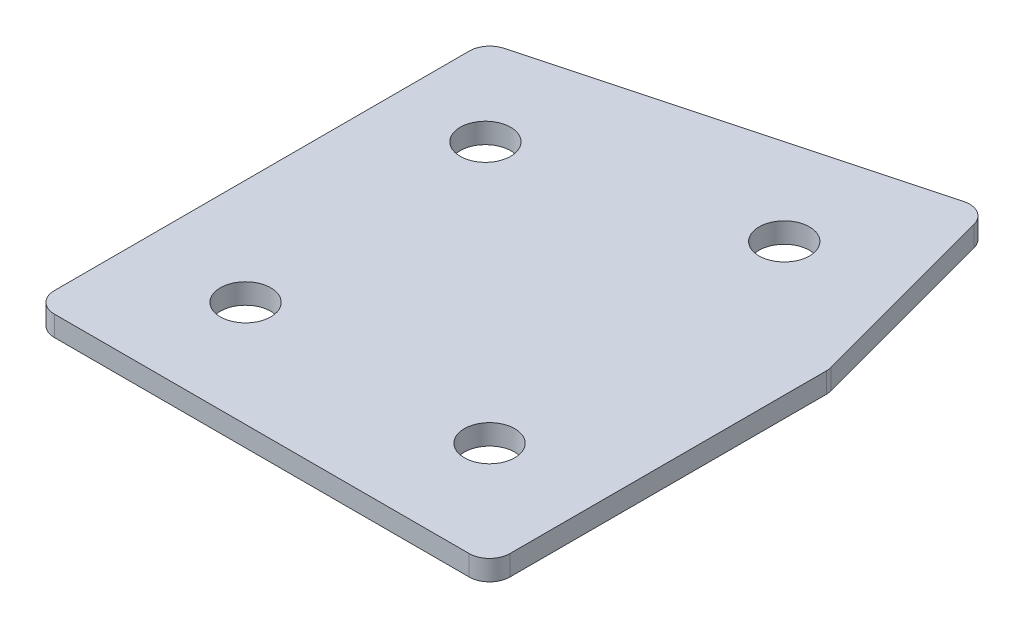
ISO-10303-21;
HEADER;
FILE_DESCRIPTION(('STEP AP214'),'2;1');
FILE_NAME('part.step','',(''),(''),'','','');
FILE_SCHEMA(('AUTOMOTIVE_DESIGN { 1 0 10303 214 1 1 1 1 }'));
ENDSEC;
DATA;
#1=APPLICATION_CONTEXT('core data for automotive mechanical design processes');
#2=APPLICATION_PROTOCOL_DEFINITION('international standard','automotive_design',2000,#1);
#3=PRODUCT_CONTEXT('',#1,'mechanical');
#4=PRODUCT('Part','Part','',(#3));
#5=PRODUCT_RELATED_PRODUCT_CATEGORY('part','',(#4));
#6=PRODUCT_DEFINITION_FORMATION('','',#4);
#7=PRODUCT_DEFINITION_CONTEXT('part definition',#1,'design');
#8=PRODUCT_DEFINITION('design','',#6,#7);
#9=PRODUCT_DEFINITION_SHAPE('','',#8);
#10=(LENGTH_UNIT() NAMED_UNIT(*) SI_UNIT(.MILLI.,.METRE.));
#11=(NAMED_UNIT(*) PLANE_ANGLE_UNIT() SI_UNIT($,.RADIAN.));
#12=(NAMED_UNIT(*) SI_UNIT($,.STERADIAN.) SOLID_ANGLE_UNIT());
#13=UNCERTAINTY_MEASURE_WITH_UNIT(LENGTH_MEASURE(1.E-05),#10,'distance_accuracy_value','');
#14=(GEOMETRIC_REPRESENTATION_CONTEXT(3) GLOBAL_UNCERTAINTY_ASSIGNED_CONTEXT((#13)) GLOBAL_UNIT_ASSIGNED_CONTEXT((#10,
#11,#12)) REPRESENTATION_CONTEXT('',''));
#15=CARTESIAN_POINT('',(0.,0.,0.));
#16=DIRECTION('',(0.,0.,1.));
#17=DIRECTION('',(1.,0.,0.));
#18=AXIS2_PLACEMENT_3D('',#15,#16,#17);
#19=CARTESIAN_POINT('',(-137.892160569637,1.24134831028641,20.2109086974348));
#20=DIRECTION('',(0.,1.,0.));
#21=DIRECTION('',(0.,0.,1.));
#22=AXIS2_PLACEMENT_3D('',#19,#20,#21);
#23=PLANE('',#22);
#24=CARTESIAN_POINT('',(13.2795797681661,1.24134831028641,20.2109086974348));
#25=DIRECTION('',(0.,1.,0.));
#26=DIRECTION('',(0.,0.,1.));
#27=AXIS2_PLACEMENT_3D('',#24,#25,#26);
#28=CIRCLE('',#27,3.09999999999999);
#29=CARTESIAN_POINT('',(13.2795797681661,1.24134831028641,23.3109086974348));
#30=VERTEX_POINT('',#29);
#31=EDGE_CURVE('E201',#30,#30,#28,.T.);
#32=ORIENTED_EDGE('',*,*,#31,.T.);
#33=EDGE_LOOP('',(#32));
#34=FACE_BOUND('',#33,.T.);
#35=CARTESIAN_POINT('',(9.9084066972922,1.24134831028641,-19.3921339426005));
#36=DIRECTION('',(0.,1.,0.));
#37=DIRECTION('',(0.,0.,1.));
#38=AXIS2_PLACEMENT_3D('',#35,#36,#37);
#39=CIRCLE('',#38,3.09999999999999);
#40=CARTESIAN_POINT('',(9.9084066972922,1.24134831028641,-16.2921339426005));
#41=VERTEX_POINT('',#40);
#42=EDGE_CURVE('E195',#41,#41,#39,.T.);
#43=ORIENTED_EDGE('',*,*,#42,.T.);
#44=EDGE_LOOP('',(#43));
#45=FACE_BOUND('',#44,.T.);
#46=CARTESIAN_POINT('',(-19.0693680913798,1.24134831028641,-11.6275625895249));
#47=DIRECTION('',(0.,1.,0.));
#48=DIRECTION('',(0.,0.,1.));
#49=AXIS2_PLACEMENT_3D('',#46,#47,#48);
#50=CIRCLE('',#49,3.1);
#51=CARTESIAN_POINT('',(-19.0693680913798,1.24134831028641,-8.52756258952485));
#52=VERTEX_POINT('',#51);
#53=EDGE_CURVE('E189',#52,#52,#50,.T.);
#54=ORIENTED_EDGE('',*,*,#53,.T.);
#55=EDGE_LOOP('',(#54));
#56=FACE_BOUND('',#55,.T.);
#57=CARTESIAN_POINT('',(-16.7204202318339,1.24134831028641,20.2109086974348));
#58=DIRECTION('',(0.,1.,0.));
#59=DIRECTION('',(0.,0.,1.));
#60=AXIS2_PLACEMENT_3D('',#57,#58,#59);
#61=CIRCLE('',#60,3.1);
#62=CARTESIAN_POINT('',(-16.7204202318339,1.24134831028641,23.3109086974348));
#63=VERTEX_POINT('',#62);
#64=EDGE_CURVE('E115',#63,#63,#61,.T.);
#65=ORIENTED_EDGE('',*,*,#64,.T.);
#66=EDGE_LOOP('',(#65));
#67=FACE_BOUND('',#66,.T.);
#68=DIRECTION('',(0.,0.,1.));
#69=VECTOR('',#68,1.);
#70=CARTESIAN_POINT('',(-29.7204202318339,1.24134831028641,-22.2322121152795));
#71=LINE('',#70,#69);
#72=CARTESIAN_POINT('',(-29.7204202318339,1.24134831028641,-20.3138946453321));
#73=VERTEX_POINT('',#72);
#74=CARTESIAN_POINT('',(-29.7204202318339,1.24134831028641,30.7109086974349));
#75=VERTEX_POINT('',#74);
#76=EDGE_CURVE('E182',#73,#75,#71,.T.);
#77=ORIENTED_EDGE('',*,*,#76,.F.);
#78=CARTESIAN_POINT('',(-27.2204202318339,1.24134831028641,-20.3138946453321));
#79=DIRECTION('',(0.,1.,0.));
#80=DIRECTION('',(0.,0.,1.));
#81=AXIS2_PLACEMENT_3D('',#78,#79,#80);
#82=CIRCLE('',#81,2.5);
#83=CARTESIAN_POINT('',(-27.8674678445902,1.24134831028641,-22.7287092110548));
#84=VERTEX_POINT('',#83);
#85=EDGE_CURVE('E146',#73,#84,#82,.F.);
#86=ORIENTED_EDGE('',*,*,#85,.T.);
#87=DIRECTION('',(-0.965925826289068,0.,0.258819045102523));
#88=VECTOR('',#87,1.);
#89=CARTESIAN_POINT('',(19.1007948527173,1.24134831028641,-35.3138172706913));
#90=LINE('',#89,#88);
#91=CARTESIAN_POINT('',(16.6859802869946,1.24134831028641,-34.6667696579349));
#92=VERTEX_POINT('',#91);
#93=EDGE_CURVE('E174',#92,#84,#90,.T.);
#94=ORIENTED_EDGE('',*,*,#93,.F.);
#95=CARTESIAN_POINT('',(17.3330278997509,1.24134831028641,-32.2519550922123));
#96=DIRECTION('',(0.,1.,0.));
#97=DIRECTION('',(0.,0.,1.));
#98=AXIS2_PLACEMENT_3D('',#95,#96,#97);
#99=CIRCLE('',#98,2.5);
#100=CARTESIAN_POINT('',(19.7478424654736,1.24134831028641,-32.8990027049686));
#101=VERTEX_POINT('',#100);
#102=EDGE_CURVE('E118',#92,#101,#99,.F.);
#103=ORIENTED_EDGE('',*,*,#102,.T.);
#104=DIRECTION('',(-0.258819045102522,0.,-0.965925826289068));
#105=VECTOR('',#104,1.);
#106=CARTESIAN_POINT('',(26.279579768166,1.24134831028641,-8.52222722962751));
#107=LINE('',#106,#105);
#108=CARTESIAN_POINT('',(26.1943943338887,1.24134831028641,-8.8401435984153));
#109=VERTEX_POINT('',#108);
#110=EDGE_CURVE('E119',#109,#101,#107,.T.);
#111=ORIENTED_EDGE('',*,*,#110,.F.);
#112=CARTESIAN_POINT('',(23.779579768166,1.24134831028641,-8.193095985659));
#113=DIRECTION('',(0.,1.,0.));
#114=DIRECTION('',(0.,0.,1.));
#115=AXIS2_PLACEMENT_3D('',#112,#113,#114);
#116=CIRCLE('',#115,2.5);
#117=CARTESIAN_POINT('',(26.279579768166,1.24134831028641,-8.193095985659));
#118=VERTEX_POINT('',#117);
#119=EDGE_CURVE('E141',#109,#118,#116,.F.);
#120=ORIENTED_EDGE('',*,*,#119,.T.);
#121=DIRECTION('',(0.,0.,-1.));
#122=VECTOR('',#121,1.);
#123=CARTESIAN_POINT('',(26.279579768166,1.24134831028641,33.2109086974349));
#124=LINE('',#123,#122);
#125=CARTESIAN_POINT('',(26.279579768166,1.24134831028641,30.7109086974349));
#126=VERTEX_POINT('',#125);
#127=EDGE_CURVE('E123',#126,#118,#124,.T.);
#128=ORIENTED_EDGE('',*,*,#127,.F.);
#129=CARTESIAN_POINT('',(23.779579768166,1.24134831028641,30.7109086974349));
#130=DIRECTION('',(0.,1.,0.));
#131=DIRECTION('',(0.,0.,1.));
#132=AXIS2_PLACEMENT_3D('',#129,#130,#131);
#133=CIRCLE('',#132,2.5);
#134=CARTESIAN_POINT('',(23.779579768166,1.24134831028641,33.2109086974349));
#135=VERTEX_POINT('',#134);
#136=EDGE_CURVE('E31',#126,#135,#133,.F.);
#137=ORIENTED_EDGE('',*,*,#136,.T.);
#138=DIRECTION('',(1.,0.,0.));
#139=VECTOR('',#138,1.);
#140=CARTESIAN_POINT('',(-29.7204202318339,1.24134831028641,33.2109086974349));
#141=LINE('',#140,#139);
#142=CARTESIAN_POINT('',(-27.2204202318339,1.24134831028641,33.2109086974349));
#143=VERTEX_POINT('',#142);
#144=EDGE_CURVE('E180',#143,#135,#141,.T.);
#145=ORIENTED_EDGE('',*,*,#144,.F.);
#146=CARTESIAN_POINT('',(-27.2204202318339,1.24134831028641,30.7109086974349));
#147=DIRECTION('',(0.,1.,0.));
#148=DIRECTION('',(0.,0.,1.));
#149=AXIS2_PLACEMENT_3D('',#146,#147,#148);
#150=CIRCLE('',#149,2.5);
#151=EDGE_CURVE('E144',#143,#75,#150,.F.);
#152=ORIENTED_EDGE('',*,*,#151,.T.);
#153=EDGE_LOOP('',(#77,#86,#94,#103,#111,#120,#128,#137,#145,#152));
#154=FACE_BOUND('',#153,.T.);
#155=ADVANCED_FACE('F16',(#34,#45,#56,#67,#154),#23,.F.);
#156=CARTESIAN_POINT('',(19.1007948527173,1.24134831028641,-35.3138172706913));
#157=DIRECTION('',(-0.258819045102523,0.,-0.965925826289068));
#158=DIRECTION('',(-0.965925826289068,0.,0.258819045102523));
#159=AXIS2_PLACEMENT_3D('',#156,#157,#158);
#160=PLANE('',#159);
#161=ORIENTED_EDGE('',*,*,#93,.T.);
#162=DIRECTION('',(0.,1.,0.));
#163=VECTOR('',#162,1.);
#164=CARTESIAN_POINT('',(-27.8674678445902,1.24134831028641,-22.7287092110548));
#165=LINE('',#164,#163);
#166=CARTESIAN_POINT('',(-27.8674678445902,3.74134831028641,-22.7287092110548));
#167=VERTEX_POINT('',#166);
#168=EDGE_CURVE('E105',#84,#167,#165,.T.);
#169=ORIENTED_EDGE('',*,*,#168,.T.);
#170=DIRECTION('',(-0.965925826289068,0.,0.258819045102523));
#171=VECTOR('',#170,1.);
#172=CARTESIAN_POINT('',(19.1007948527173,3.74134831028641,-35.3138172706913));
#173=LINE('',#172,#171);
#174=CARTESIAN_POINT('',(16.6859802869946,3.74134831028641,-34.6667696579349));
#175=VERTEX_POINT('',#174);
#176=EDGE_CURVE('E97',#175,#167,#173,.T.);
#177=ORIENTED_EDGE('',*,*,#176,.F.);
#178=DIRECTION('',(0.,1.,0.));
#179=VECTOR('',#178,1.);
#180=CARTESIAN_POINT('',(16.6859802869946,1.24134831028641,-34.6667696579349));
#181=LINE('',#180,#179);
#182=EDGE_CURVE('E111',#175,#92,#181,.F.);
#183=ORIENTED_EDGE('',*,*,#182,.T.);
#184=EDGE_LOOP('',(#161,#169,#177,#183));
#185=FACE_BOUND('',#184,.T.);
#186=ADVANCED_FACE('F110',(#185),#160,.T.);
#187=CARTESIAN_POINT('',(26.279579768166,1.24134831028641,-8.52222722962751));
#188=DIRECTION('',(0.965925826289068,0.,-0.258819045102522));
#189=DIRECTION('',(-0.258819045102522,0.,-0.965925826289068));
#190=AXIS2_PLACEMENT_3D('',#187,#188,#189);
#191=PLANE('',#190);
#192=DIRECTION('',(-0.258819045102522,0.,-0.965925826289068));
#193=VECTOR('',#192,1.);
#194=CARTESIAN_POINT('',(26.279579768166,3.74134831028641,-8.52222722962751));
#195=LINE('',#194,#193);
#196=CARTESIAN_POINT('',(26.1943943338887,3.74134831028641,-8.8401435984153));
#197=VERTEX_POINT('',#196);
#198=CARTESIAN_POINT('',(19.7478424654736,3.74134831028641,-32.8990027049686));
#199=VERTEX_POINT('',#198);
#200=EDGE_CURVE('E99',#197,#199,#195,.T.);
#201=ORIENTED_EDGE('',*,*,#200,.F.);
#202=DIRECTION('',(0.,1.,0.));
#203=VECTOR('',#202,1.);
#204=CARTESIAN_POINT('',(26.1943943338887,1.24134831028641,-8.8401435984153));
#205=LINE('',#204,#203);
#206=EDGE_CURVE('E10',#197,#109,#205,.F.);
#207=ORIENTED_EDGE('',*,*,#206,.T.);
#208=ORIENTED_EDGE('',*,*,#110,.T.);
#209=DIRECTION('',(0.,1.,0.));
#210=VECTOR('',#209,1.);
#211=CARTESIAN_POINT('',(19.7478424654736,1.24134831028641,-32.8990027049686));
#212=LINE('',#211,#210);
#213=EDGE_CURVE('E24',#101,#199,#212,.T.);
#214=ORIENTED_EDGE('',*,*,#213,.T.);
#215=EDGE_LOOP('',(#201,#207,#208,#214));
#216=FACE_BOUND('',#215,.T.);
#217=ADVANCED_FACE('F157',(#216),#191,.T.);
#218=CARTESIAN_POINT('',(26.279579768166,1.24134831028641,33.2109086974349));
#219=DIRECTION('',(1.,0.,0.));
#220=DIRECTION('',(0.,0.,-1.));
#221=AXIS2_PLACEMENT_3D('',#218,#219,#220);
#222=PLANE('',#221);
#223=DIRECTION('',(0.,0.,-1.));
#224=VECTOR('',#223,1.);
#225=CARTESIAN_POINT('',(26.279579768166,3.74134831028641,33.2109086974349));
#226=LINE('',#225,#224);
#227=CARTESIAN_POINT('',(26.279579768166,3.74134831028641,30.7109086974349));
#228=VERTEX_POINT('',#227);
#229=CARTESIAN_POINT('',(26.279579768166,3.74134831028641,-8.193095985659));
#230=VERTEX_POINT('',#229);
#231=EDGE_CURVE('E170',#228,#230,#226,.T.);
#232=ORIENTED_EDGE('',*,*,#231,.F.);
#233=DIRECTION('',(0.,1.,0.));
#234=VECTOR('',#233,1.);
#235=CARTESIAN_POINT('',(26.279579768166,1.24134831028641,30.7109086974349));
#236=LINE('',#235,#234);
#237=EDGE_CURVE('E155',#228,#126,#236,.F.);
#238=ORIENTED_EDGE('',*,*,#237,.T.);
#239=ORIENTED_EDGE('',*,*,#127,.T.);
#240=DIRECTION('',(0.,1.,0.));
#241=VECTOR('',#240,1.);
#242=CARTESIAN_POINT('',(26.279579768166,1.24134831028641,-8.193095985659));
#243=LINE('',#242,#241);
#244=EDGE_CURVE('E152',#118,#230,#243,.T.);
#245=ORIENTED_EDGE('',*,*,#244,.T.);
#246=EDGE_LOOP('',(#232,#238,#239,#245));
#247=FACE_BOUND('',#246,.T.);
#248=ADVANCED_FACE('F169',(#247),#222,.T.);
#249=CARTESIAN_POINT('',(-29.7204202318339,1.24134831028641,33.2109086974349));
#250=DIRECTION('',(0.,0.,1.));
#251=DIRECTION('',(1.,0.,0.));
#252=AXIS2_PLACEMENT_3D('',#249,#250,#251);
#253=PLANE('',#252);
#254=DIRECTION('',(1.,0.,0.));
#255=VECTOR('',#254,1.);
#256=CARTESIAN_POINT('',(-29.7204202318339,3.74134831028641,33.2109086974349));
#257=LINE('',#256,#255);
#258=CARTESIAN_POINT('',(-27.2204202318339,3.74134831028641,33.2109086974349));
#259=VERTEX_POINT('',#258);
#260=CARTESIAN_POINT('',(23.779579768166,3.74134831028641,33.2109086974349));
#261=VERTEX_POINT('',#260);
#262=EDGE_CURVE('E173',#259,#261,#257,.T.);
#263=ORIENTED_EDGE('',*,*,#262,.F.);
#264=DIRECTION('',(0.,1.,0.));
#265=VECTOR('',#264,1.);
#266=CARTESIAN_POINT('',(-27.2204202318339,1.24134831028641,33.2109086974349));
#267=LINE('',#266,#265);
#268=EDGE_CURVE('E38',#259,#143,#267,.F.);
#269=ORIENTED_EDGE('',*,*,#268,.T.);
#270=ORIENTED_EDGE('',*,*,#144,.T.);
#271=DIRECTION('',(0.,1.,0.));
#272=VECTOR('',#271,1.);
#273=CARTESIAN_POINT('',(23.779579768166,1.24134831028641,33.2109086974349));
#274=LINE('',#273,#272);
#275=EDGE_CURVE('E148',#135,#261,#274,.T.);
#276=ORIENTED_EDGE('',*,*,#275,.T.);
#277=EDGE_LOOP('',(#263,#269,#270,#276));
#278=FACE_BOUND('',#277,.T.);
#279=ADVANCED_FACE('F333',(#278),#253,.T.);
#280=CARTESIAN_POINT('',(-29.7204202318339,1.24134831028641,-22.2322121152795));
#281=DIRECTION('',(-1.,0.,0.));
#282=DIRECTION('',(0.,0.,1.));
#283=AXIS2_PLACEMENT_3D('',#280,#281,#282);
#284=PLANE('',#283);
#285=DIRECTION('',(0.,0.,1.));
#286=VECTOR('',#285,1.);
#287=CARTESIAN_POINT('',(-29.7204202318339,3.74134831028641,-22.2322121152795));
#288=LINE('',#287,#286);
#289=CARTESIAN_POINT('',(-29.7204202318339,3.74134831028641,-20.3138946453321));
#290=VERTEX_POINT('',#289);
#291=CARTESIAN_POINT('',(-29.7204202318339,3.74134831028641,30.7109086974349));
#292=VERTEX_POINT('',#291);
#293=EDGE_CURVE('E114',#290,#292,#288,.T.);
#294=ORIENTED_EDGE('',*,*,#293,.F.);
#295=DIRECTION('',(0.,1.,0.));
#296=VECTOR('',#295,1.);
#297=CARTESIAN_POINT('',(-29.7204202318339,1.24134831028641,-20.3138946453321));
#298=LINE('',#297,#296);
#299=EDGE_CURVE('E138',#290,#73,#298,.F.);
#300=ORIENTED_EDGE('',*,*,#299,.T.);
#301=ORIENTED_EDGE('',*,*,#76,.T.);
#302=DIRECTION('',(0.,1.,0.));
#303=VECTOR('',#302,1.);
#304=CARTESIAN_POINT('',(-29.7204202318339,1.24134831028641,30.7109086974349));
#305=LINE('',#304,#303);
#306=EDGE_CURVE('E135',#75,#292,#305,.T.);
#307=ORIENTED_EDGE('',*,*,#306,.T.);
#308=EDGE_LOOP('',(#294,#300,#301,#307));
#309=FACE_BOUND('',#308,.T.);
#310=ADVANCED_FACE('F223',(#309),#284,.T.);
#311=CARTESIAN_POINT('',(-137.892160569637,3.74134831028641,20.2109086974348));
#312=DIRECTION('',(0.,1.,0.));
#313=DIRECTION('',(0.,0.,1.));
#314=AXIS2_PLACEMENT_3D('',#311,#312,#313);
#315=PLANE('',#314);
#316=CARTESIAN_POINT('',(13.2795797681661,3.74134831028641,20.2109086974348));
#317=DIRECTION('',(0.,1.,0.));
#318=DIRECTION('',(0.,0.,1.));
#319=AXIS2_PLACEMENT_3D('',#316,#317,#318);
#320=CIRCLE('',#319,3.09999999999999);
#321=CARTESIAN_POINT('',(13.2795797681661,3.74134831028641,23.3109086974348));
#322=VERTEX_POINT('',#321);
#323=EDGE_CURVE('E204',#322,#322,#320,.T.);
#324=ORIENTED_EDGE('',*,*,#323,.F.);
#325=EDGE_LOOP('',(#324));
#326=FACE_BOUND('',#325,.T.);
#327=CARTESIAN_POINT('',(9.9084066972922,3.74134831028641,-19.3921339426005));
#328=DIRECTION('',(0.,1.,0.));
#329=DIRECTION('',(0.,0.,1.));
#330=AXIS2_PLACEMENT_3D('',#327,#328,#329);
#331=CIRCLE('',#330,3.09999999999999);
#332=CARTESIAN_POINT('',(9.9084066972922,3.74134831028641,-16.2921339426005));
#333=VERTEX_POINT('',#332);
#334=EDGE_CURVE('E198',#333,#333,#331,.T.);
#335=ORIENTED_EDGE('',*,*,#334,.F.);
#336=EDGE_LOOP('',(#335));
#337=FACE_BOUND('',#336,.T.);
#338=CARTESIAN_POINT('',(-19.0693680913798,3.74134831028641,-11.6275625895249));
#339=DIRECTION('',(0.,1.,0.));
#340=DIRECTION('',(0.,0.,1.));
#341=AXIS2_PLACEMENT_3D('',#338,#339,#340);
#342=CIRCLE('',#341,3.1);
#343=CARTESIAN_POINT('',(-19.0693680913798,3.74134831028641,-8.52756258952485));
#344=VERTEX_POINT('',#343);
#345=EDGE_CURVE('E192',#344,#344,#342,.T.);
#346=ORIENTED_EDGE('',*,*,#345,.F.);
#347=EDGE_LOOP('',(#346));
#348=FACE_BOUND('',#347,.T.);
#349=CARTESIAN_POINT('',(-16.7204202318339,3.74134831028641,20.2109086974348));
#350=DIRECTION('',(0.,1.,0.));
#351=DIRECTION('',(0.,0.,1.));
#352=AXIS2_PLACEMENT_3D('',#349,#350,#351);
#353=CIRCLE('',#352,3.1);
#354=CARTESIAN_POINT('',(-16.7204202318339,3.74134831028641,23.3109086974348));
#355=VERTEX_POINT('',#354);
#356=EDGE_CURVE('E186',#355,#355,#353,.T.);
#357=ORIENTED_EDGE('',*,*,#356,.F.);
#358=EDGE_LOOP('',(#357));
#359=FACE_BOUND('',#358,.T.);
#360=ORIENTED_EDGE('',*,*,#176,.T.);
#361=CARTESIAN_POINT('',(-27.2204202318339,3.74134831028641,-20.3138946453321));
#362=DIRECTION('',(0.,1.,0.));
#363=DIRECTION('',(0.,0.,1.));
#364=AXIS2_PLACEMENT_3D('',#361,#362,#363);
#365=CIRCLE('',#364,2.5);
#366=EDGE_CURVE('E133',#167,#290,#365,.T.);
#367=ORIENTED_EDGE('',*,*,#366,.T.);
#368=ORIENTED_EDGE('',*,*,#293,.T.);
#369=CARTESIAN_POINT('',(-27.2204202318339,3.74134831028641,30.7109086974349));
#370=DIRECTION('',(0.,1.,0.));
#371=DIRECTION('',(0.,0.,1.));
#372=AXIS2_PLACEMENT_3D('',#369,#370,#371);
#373=CIRCLE('',#372,2.5);
#374=EDGE_CURVE('E131',#292,#259,#373,.T.);
#375=ORIENTED_EDGE('',*,*,#374,.T.);
#376=ORIENTED_EDGE('',*,*,#262,.T.);
#377=CARTESIAN_POINT('',(23.779579768166,3.74134831028641,30.7109086974349));
#378=DIRECTION('',(0.,1.,0.));
#379=DIRECTION('',(0.,0.,1.));
#380=AXIS2_PLACEMENT_3D('',#377,#378,#379);
#381=CIRCLE('',#380,2.5);
#382=EDGE_CURVE('E129',#261,#228,#381,.T.);
#383=ORIENTED_EDGE('',*,*,#382,.T.);
#384=ORIENTED_EDGE('',*,*,#231,.T.);
#385=CARTESIAN_POINT('',(23.779579768166,3.74134831028641,-8.193095985659));
#386=DIRECTION('',(0.,1.,0.));
#387=DIRECTION('',(0.,0.,1.));
#388=AXIS2_PLACEMENT_3D('',#385,#386,#387);
#389=CIRCLE('',#388,2.5);
#390=EDGE_CURVE('E104',#230,#197,#389,.T.);
#391=ORIENTED_EDGE('',*,*,#390,.T.);
#392=ORIENTED_EDGE('',*,*,#200,.T.);
#393=CARTESIAN_POINT('',(17.3330278997509,3.74134831028641,-32.2519550922123));
#394=DIRECTION('',(0.,1.,0.));
#395=DIRECTION('',(0.,0.,1.));
#396=AXIS2_PLACEMENT_3D('',#393,#394,#395);
#397=CIRCLE('',#396,2.5);
#398=EDGE_CURVE('E94',#199,#175,#397,.T.);
#399=ORIENTED_EDGE('',*,*,#398,.T.);
#400=EDGE_LOOP('',(#360,#367,#368,#375,#376,#383,#384,#391,#392,#399));
#401=FACE_BOUND('',#400,.T.);
#402=ADVANCED_FACE('F96',(#326,#337,#348,#359,#401),#315,.T.);
#403=CARTESIAN_POINT('',(-16.7204202318339,1.24134831028641,20.2109086974348));
#404=DIRECTION('',(0.,1.,0.));
#405=DIRECTION('',(0.,0.,1.));
#406=AXIS2_PLACEMENT_3D('',#403,#404,#405);
#407=CYLINDRICAL_SURFACE('',#406,3.1);
#408=ORIENTED_EDGE('',*,*,#64,.F.);
#409=EDGE_LOOP('',(#408));
#410=FACE_BOUND('',#409,.T.);
#411=ORIENTED_EDGE('',*,*,#356,.T.);
#412=EDGE_LOOP('',(#411));
#413=FACE_BOUND('',#412,.T.);
#414=ADVANCED_FACE('F222',(#410,#413),#407,.F.);
#415=CARTESIAN_POINT('',(-19.0693680913798,1.24134831028641,-11.6275625895249));
#416=DIRECTION('',(0.,1.,0.));
#417=DIRECTION('',(0.,0.,1.));
#418=AXIS2_PLACEMENT_3D('',#415,#416,#417);
#419=CYLINDRICAL_SURFACE('',#418,3.1);
#420=ORIENTED_EDGE('',*,*,#53,.F.);
#421=EDGE_LOOP('',(#420));
#422=FACE_BOUND('',#421,.T.);
#423=ORIENTED_EDGE('',*,*,#345,.T.);
#424=EDGE_LOOP('',(#423));
#425=FACE_BOUND('',#424,.T.);
#426=ADVANCED_FACE('F232',(#422,#425),#419,.F.);
#427=CARTESIAN_POINT('',(9.9084066972922,1.24134831028641,-19.3921339426005));
#428=DIRECTION('',(0.,1.,0.));
#429=DIRECTION('',(0.,0.,1.));
#430=AXIS2_PLACEMENT_3D('',#427,#428,#429);
#431=CYLINDRICAL_SURFACE('',#430,3.09999999999999);
#432=ORIENTED_EDGE('',*,*,#42,.F.);
#433=EDGE_LOOP('',(#432));
#434=FACE_BOUND('',#433,.T.);
#435=ORIENTED_EDGE('',*,*,#334,.T.);
#436=EDGE_LOOP('',(#435));
#437=FACE_BOUND('',#436,.T.);
#438=ADVANCED_FACE('F216',(#434,#437),#431,.F.);
#439=CARTESIAN_POINT('',(13.2795797681661,1.24134831028641,20.2109086974348));
#440=DIRECTION('',(0.,1.,0.));
#441=DIRECTION('',(0.,0.,1.));
#442=AXIS2_PLACEMENT_3D('',#439,#440,#441);
#443=CYLINDRICAL_SURFACE('',#442,3.09999999999999);
#444=ORIENTED_EDGE('',*,*,#31,.F.);
#445=EDGE_LOOP('',(#444));
#446=FACE_BOUND('',#445,.T.);
#447=ORIENTED_EDGE('',*,*,#323,.T.);
#448=EDGE_LOOP('',(#447));
#449=FACE_BOUND('',#448,.T.);
#450=ADVANCED_FACE('F212',(#446,#449),#443,.F.);
#451=CARTESIAN_POINT('',(-27.2204202318339,1.24134831028641,-20.3138946453321));
#452=DIRECTION('',(0.,1.,0.));
#453=DIRECTION('',(0.,0.,1.));
#454=AXIS2_PLACEMENT_3D('',#451,#452,#453);
#455=CYLINDRICAL_SURFACE('',#454,2.5);
#456=ORIENTED_EDGE('',*,*,#85,.F.);
#457=ORIENTED_EDGE('',*,*,#299,.F.);
#458=ORIENTED_EDGE('',*,*,#366,.F.);
#459=ORIENTED_EDGE('',*,*,#168,.F.);
#460=EDGE_LOOP('',(#456,#457,#458,#459));
#461=FACE_BOUND('',#460,.T.);
#462=ADVANCED_FACE('F215',(#461),#455,.T.);
#463=CARTESIAN_POINT('',(-27.2204202318339,1.24134831028641,30.7109086974349));
#464=DIRECTION('',(0.,1.,0.));
#465=DIRECTION('',(0.,0.,1.));
#466=AXIS2_PLACEMENT_3D('',#463,#464,#465);
#467=CYLINDRICAL_SURFACE('',#466,2.5);
#468=ORIENTED_EDGE('',*,*,#151,.F.);
#469=ORIENTED_EDGE('',*,*,#268,.F.);
#470=ORIENTED_EDGE('',*,*,#374,.F.);
#471=ORIENTED_EDGE('',*,*,#306,.F.);
#472=EDGE_LOOP('',(#468,#469,#470,#471));
#473=FACE_BOUND('',#472,.T.);
#474=ADVANCED_FACE('F252',(#473),#467,.T.);
#475=CARTESIAN_POINT('',(23.779579768166,1.24134831028641,30.7109086974349));
#476=DIRECTION('',(0.,1.,0.));
#477=DIRECTION('',(0.,0.,1.));
#478=AXIS2_PLACEMENT_3D('',#475,#476,#477);
#479=CYLINDRICAL_SURFACE('',#478,2.5);
#480=ORIENTED_EDGE('',*,*,#136,.F.);
#481=ORIENTED_EDGE('',*,*,#237,.F.);
#482=ORIENTED_EDGE('',*,*,#382,.F.);
#483=ORIENTED_EDGE('',*,*,#275,.F.);
#484=EDGE_LOOP('',(#480,#481,#482,#483));
#485=FACE_BOUND('',#484,.T.);
#486=ADVANCED_FACE('F256',(#485),#479,.T.);
#487=CARTESIAN_POINT('',(23.779579768166,1.24134831028641,-8.193095985659));
#488=DIRECTION('',(0.,1.,0.));
#489=DIRECTION('',(0.,0.,1.));
#490=AXIS2_PLACEMENT_3D('',#487,#488,#489);
#491=CYLINDRICAL_SURFACE('',#490,2.5);
#492=ORIENTED_EDGE('',*,*,#119,.F.);
#493=ORIENTED_EDGE('',*,*,#206,.F.);
#494=ORIENTED_EDGE('',*,*,#390,.F.);
#495=ORIENTED_EDGE('',*,*,#244,.F.);
#496=EDGE_LOOP('',(#492,#493,#494,#495));
#497=FACE_BOUND('',#496,.T.);
#498=ADVANCED_FACE('F165',(#497),#491,.T.);
#499=CARTESIAN_POINT('',(17.3330278997509,1.24134831028641,-32.2519550922123));
#500=DIRECTION('',(0.,1.,0.));
#501=DIRECTION('',(0.,0.,1.));
#502=AXIS2_PLACEMENT_3D('',#499,#500,#501);
#503=CYLINDRICAL_SURFACE('',#502,2.5);
#504=ORIENTED_EDGE('',*,*,#102,.F.);
#505=ORIENTED_EDGE('',*,*,#182,.F.);
#506=ORIENTED_EDGE('',*,*,#398,.F.);
#507=ORIENTED_EDGE('',*,*,#213,.F.);
#508=EDGE_LOOP('',(#504,#505,#506,#507));
#509=FACE_BOUND('',#508,.T.);
#510=ADVANCED_FACE('F18',(#509),#503,.T.);
#511=CLOSED_SHELL('',(#155,#186,#217,#248,#279,#310,#402,#414,#426,#438,#450,#462,#474,#486,
#498,#510));
#512=MANIFOLD_SOLID_BREP('B1',#511);
#513=ADVANCED_BREP_SHAPE_REPRESENTATION('',(#18,#512),#14);
#514=SHAPE_DEFINITION_REPRESENTATION(#9,#513);
ENDSEC;
END-ISO-10303-21;
